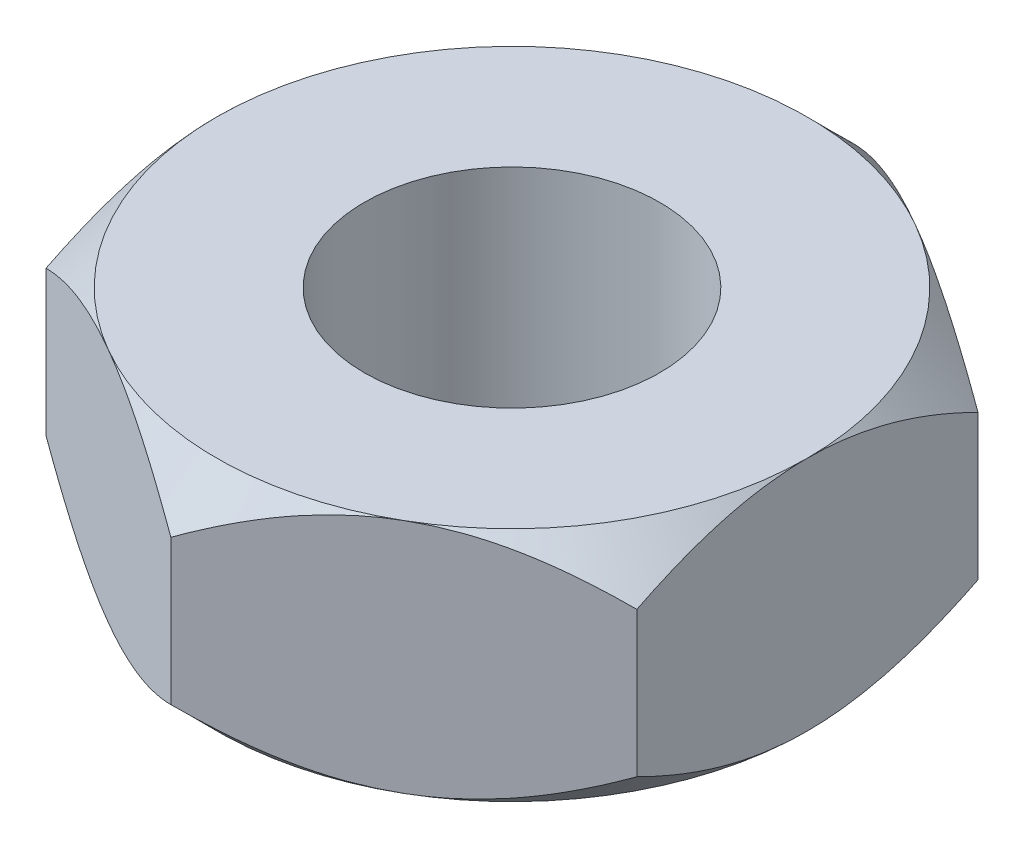
ISO-10303-21;
HEADER;
FILE_DESCRIPTION(('STEP AP214'),'2;1');
FILE_NAME('part.step','',(''),(''),'','','');
FILE_SCHEMA(('AUTOMOTIVE_DESIGN { 1 0 10303 214 1 1 1 1 }'));
ENDSEC;
DATA;
#1=APPLICATION_CONTEXT('core data for automotive mechanical design processes');
#2=APPLICATION_PROTOCOL_DEFINITION('international standard','automotive_design',2000,#1);
#3=PRODUCT_CONTEXT('',#1,'mechanical');
#4=PRODUCT('Part','Part','',(#3));
#5=PRODUCT_RELATED_PRODUCT_CATEGORY('part','',(#4));
#6=PRODUCT_DEFINITION_FORMATION('','',#4);
#7=PRODUCT_DEFINITION_CONTEXT('part definition',#1,'design');
#8=PRODUCT_DEFINITION('design','',#6,#7);
#9=PRODUCT_DEFINITION_SHAPE('','',#8);
#10=(LENGTH_UNIT() NAMED_UNIT(*) SI_UNIT(.MILLI.,.METRE.));
#11=(NAMED_UNIT(*) PLANE_ANGLE_UNIT() SI_UNIT($,.RADIAN.));
#12=(NAMED_UNIT(*) SI_UNIT($,.STERADIAN.) SOLID_ANGLE_UNIT());
#13=UNCERTAINTY_MEASURE_WITH_UNIT(LENGTH_MEASURE(1.E-05),#10,'distance_accuracy_value','');
#14=(GEOMETRIC_REPRESENTATION_CONTEXT(3) GLOBAL_UNCERTAINTY_ASSIGNED_CONTEXT((#13)) GLOBAL_UNIT_ASSIGNED_CONTEXT((#10,
#11,#12)) REPRESENTATION_CONTEXT('',''));
#15=CARTESIAN_POINT('',(0.,0.,0.));
#16=DIRECTION('',(0.,0.,1.));
#17=DIRECTION('',(1.,0.,0.));
#18=AXIS2_PLACEMENT_3D('',#15,#16,#17);
#19=CARTESIAN_POINT('',(2.5,2.,-1.44337567297407));
#20=DIRECTION('',(-0.5,0.,0.866025403784439));
#21=DIRECTION('',(0.866025403784439,0.,0.5));
#22=AXIS2_PLACEMENT_3D('',#19,#20,#21);
#23=PLANE('',#22);
#24=CARTESIAN_POINT('',(-0.000199999999999338,0.386866822929892,-2.88686681600197));
#25=CARTESIAN_POINT('',(0.0857382777877658,0.337292051302855,-2.83725032818751));
#26=CARTESIAN_POINT('',(0.173113567275755,0.290628827310634,-2.7868041812811));
#27=CARTESIAN_POINT('',(0.35128145616559,0.205189485986429,-2.6839389026696));
#28=CARTESIAN_POINT('',(0.442091000681076,0.166460908354131,-2.6315099876986));
#29=CARTESIAN_POINT('',(0.625204123126922,0.100118049845867,-2.52578957716234));
#30=CARTESIAN_POINT('',(0.717461064529342,0.0723370144789851,-2.47252500720904));
#31=CARTESIAN_POINT('',(0.904006008776287,0.0295345218587951,-2.3648232334321));
#32=CARTESIAN_POINT('',(0.998288312566284,0.0144811126194732,-2.31038931995913));
#33=CARTESIAN_POINT('',(1.16077825829185,0.000899068157610821,-2.21657570605387));
#34=CARTESIAN_POINT('',(1.22877596788015,-0.00111155481106936,-2.17731721011878));
#35=CARTESIAN_POINT('',(1.36466024116922,0.00227546313561769,-2.0988643883567));
#36=CARTESIAN_POINT('',(1.43254675755224,0.0076757012479502,-2.05967008984862));
#37=CARTESIAN_POINT('',(1.56767878823611,0.0255771343506018,-1.98165157555715));
#38=CARTESIAN_POINT('',(1.63492349975356,0.0380862729946106,-1.94282782326097));
#39=CARTESIAN_POINT('',(1.7682501008182,0.0695188479038369,-1.86585167424616));
#40=CARTESIAN_POINT('',(1.83433207909966,0.0884417924449483,-1.82769922629678));
#41=CARTESIAN_POINT('',(2.00359634669127,0.144618707356377,-1.72997445583858));
#42=CARTESIAN_POINT('',(2.10572912222289,0.186107177544317,-1.67100807039231));
#43=CARTESIAN_POINT('',(2.25590641494051,0.256145392671217,-1.58430317001562));
#44=CARTESIAN_POINT('',(2.30539653988261,0.280753598064203,-1.55573003305807));
#45=CARTESIAN_POINT('',(2.40346006383885,0.332213232663364,-1.49911303110426));
#46=CARTESIAN_POINT('',(2.45203400349693,0.359063284727484,-1.47106885396706));
#47=CARTESIAN_POINT('',(2.5002,0.386866822929892,-1.44326020292023));
#48=B_SPLINE_CURVE_WITH_KNOTS('',3,(#24,#25,#26,#27,#28,#29,#30,#31,#32,#33,#34,#35,#36,#37,#38,
#39,#40,#41,#42,#43,#44,#45,#46,#47),.UNSPECIFIED.,.F.,.F.,(4,2,2,2,2,2,2,2,2,2,2,4),(0.,
0.333012085133925,0.667964518301398,0.997597032043299,1.32639954393844,1.56169424147169,
1.79707142102083,2.03271213522171,2.26833478775651,2.64260240809533,2.82922877818864,
3.01574133749025),.UNSPECIFIED.);
#49=CARTESIAN_POINT('',(0.,0.386751345948129,-2.88675134594813));
#50=VERTEX_POINT('',#49);
#51=CARTESIAN_POINT('',(1.25,0.,-2.1650635094611));
#52=VERTEX_POINT('',#51);
#53=EDGE_CURVE('E52',#50,#52,#48,.T.);
#54=ORIENTED_EDGE('',*,*,#53,.F.);
#55=DIRECTION('',(0.,-1.,0.));
#56=VECTOR('',#55,1.);
#57=CARTESIAN_POINT('',(0.,2.,-2.88675134594813));
#58=LINE('',#57,#56);
#59=CARTESIAN_POINT('',(0.,1.61324865405187,-2.88675134594813));
#60=VERTEX_POINT('',#59);
#61=EDGE_CURVE('E278',#60,#50,#58,.T.);
#62=ORIENTED_EDGE('',*,*,#61,.F.);
#63=CARTESIAN_POINT('',(2.5002,1.61313317707011,-1.44326020292023));
#64=CARTESIAN_POINT('',(2.41426172221224,1.66270794869714,-1.49287669073469));
#65=CARTESIAN_POINT('',(2.32688643272425,1.70937117268937,-1.5433228376411));
#66=CARTESIAN_POINT('',(2.14871854383441,1.79481051401357,-1.64618811625259));
#67=CARTESIAN_POINT('',(2.05790899931892,1.83353909164587,-1.6986170312236));
#68=CARTESIAN_POINT('',(1.87479587687308,1.89988195015413,-1.80433744175986));
#69=CARTESIAN_POINT('',(1.78253893547066,1.92766298552102,-1.85760201171316));
#70=CARTESIAN_POINT('',(1.59599399122371,1.97046547814121,-1.96530378549009));
#71=CARTESIAN_POINT('',(1.50171168743372,1.98551888738053,-2.01973769896307));
#72=CARTESIAN_POINT('',(1.33922174170815,1.99910093184239,-2.11355131286833));
#73=CARTESIAN_POINT('',(1.27122403211985,2.00111155481107,-2.15280980880341));
#74=CARTESIAN_POINT('',(1.13533975883078,1.99772453686438,-2.2312626305655));
#75=CARTESIAN_POINT('',(1.06745324244776,1.99232429875205,-2.27045692907358));
#76=CARTESIAN_POINT('',(0.932321211763893,1.9744228656494,-2.34847544336505));
#77=CARTESIAN_POINT('',(0.865076500246439,1.96191372700539,-2.38729919566123));
#78=CARTESIAN_POINT('',(0.7317498991818,1.93048115209616,-2.46427534467604));
#79=CARTESIAN_POINT('',(0.665667920900342,1.91155820755505,-2.50242779262542));
#80=CARTESIAN_POINT('',(0.496403653308734,1.85538129264362,-2.60015256308362));
#81=CARTESIAN_POINT('',(0.394270877777107,1.81389282245568,-2.65911894852989));
#82=CARTESIAN_POINT('',(0.244093585059492,1.74385460732878,-2.74582384890657));
#83=CARTESIAN_POINT('',(0.194603460117391,1.7192464019358,-2.77439698586412));
#84=CARTESIAN_POINT('',(0.0965399361611543,1.66778676733664,-2.83101398781794));
#85=CARTESIAN_POINT('',(0.0479659965030732,1.64093671527252,-2.85905816495513));
#86=CARTESIAN_POINT('',(-0.000199999999998868,1.61313317707011,-2.88686681600197));
#87=B_SPLINE_CURVE_WITH_KNOTS('',3,(#63,#64,#65,#66,#67,#68,#69,#70,#71,#72,#73,#74,#75,#76,#77,
#78,#79,#80,#81,#82,#83,#84,#85,#86),.UNSPECIFIED.,.F.,.F.,(4,2,2,2,2,2,2,2,2,2,2,4),(0.,
0.333012085133924,0.667964518301397,0.997597032043299,1.32639954393844,1.56169424147169,
1.79707142102083,2.03271213522171,2.26833478775651,2.64260240809533,2.82922877818864,
3.01574133749025),.UNSPECIFIED.);
#88=CARTESIAN_POINT('',(1.25,2.,-2.1650635094611));
#89=VERTEX_POINT('',#88);
#90=EDGE_CURVE('E250',#89,#60,#87,.T.);
#91=ORIENTED_EDGE('',*,*,#90,.F.);
#92=CARTESIAN_POINT('',(2.5,1.61324865405187,-1.44337567297407));
#93=VERTEX_POINT('',#92);
#94=EDGE_CURVE('E318',#93,#89,#87,.T.);
#95=ORIENTED_EDGE('',*,*,#94,.F.);
#96=DIRECTION('',(0.,-1.,0.));
#97=VECTOR('',#96,1.);
#98=CARTESIAN_POINT('',(2.5,2.,-1.44337567297407));
#99=LINE('',#98,#97);
#100=CARTESIAN_POINT('',(2.5,0.386751345948128,-1.44337567297407));
#101=VERTEX_POINT('',#100);
#102=EDGE_CURVE('E320',#93,#101,#99,.T.);
#103=ORIENTED_EDGE('',*,*,#102,.T.);
#104=EDGE_CURVE('E137',#52,#101,#48,.T.);
#105=ORIENTED_EDGE('',*,*,#104,.F.);
#106=EDGE_LOOP('',(#54,#62,#91,#95,#103,#105));
#107=FACE_BOUND('',#106,.T.);
#108=ADVANCED_FACE('F36',(#107),#23,.F.);
#109=CARTESIAN_POINT('',(0.,2.,-2.88675134594813));
#110=DIRECTION('',(0.5,0.,0.866025403784439));
#111=DIRECTION('',(0.866025403784439,0.,-0.5));
#112=AXIS2_PLACEMENT_3D('',#109,#110,#111);
#113=PLANE('',#112);
#114=CARTESIAN_POINT('',(-2.5002,0.386866822929892,-1.44326020292023));
#115=CARTESIAN_POINT('',(-2.41426172221224,0.337292051302855,-1.49287669073469));
#116=CARTESIAN_POINT('',(-2.32688643272425,0.290628827310634,-1.5433228376411));
#117=CARTESIAN_POINT('',(-2.14871854383441,0.205189485986429,-1.64618811625259));
#118=CARTESIAN_POINT('',(-2.05790899931893,0.16646090835413,-1.6986170312236));
#119=CARTESIAN_POINT('',(-1.87479587687308,0.100118049845867,-1.80433744175986));
#120=CARTESIAN_POINT('',(-1.78253893547066,0.0723370144789846,-1.85760201171316));
#121=CARTESIAN_POINT('',(-1.59599399122371,0.0295345218587945,-1.96530378549009));
#122=CARTESIAN_POINT('',(-1.50171168743372,0.0144811126194725,-2.01973769896307));
#123=CARTESIAN_POINT('',(-1.33922174170815,0.000899068157610402,-2.11355131286833));
#124=CARTESIAN_POINT('',(-1.27122403211985,-0.00111155481106953,-2.15280980880341));
#125=CARTESIAN_POINT('',(-1.13533975883078,0.00227546313561764,-2.23126263056549));
#126=CARTESIAN_POINT('',(-1.06745324244776,0.00767570124795,-2.27045692907358));
#127=CARTESIAN_POINT('',(-0.932321211763893,0.0255771343506014,-2.34847544336505));
#128=CARTESIAN_POINT('',(-0.865076500246439,0.03808627299461,-2.38729919566123));
#129=CARTESIAN_POINT('',(-0.7317498991818,0.0695188479038363,-2.46427534467604));
#130=CARTESIAN_POINT('',(-0.665667920900342,0.0884417924449479,-2.50242779262542));
#131=CARTESIAN_POINT('',(-0.496403653308734,0.144618707356377,-2.60015256308362));
#132=CARTESIAN_POINT('',(-0.394270877777106,0.186107177544317,-2.65911894852989));
#133=CARTESIAN_POINT('',(-0.24409358505949,0.256145392671217,-2.74582384890657));
#134=CARTESIAN_POINT('',(-0.19460346011739,0.280753598064203,-2.77439698586412));
#135=CARTESIAN_POINT('',(-0.0965399361611525,0.332213232663364,-2.83101398781794));
#136=CARTESIAN_POINT('',(-0.0479659965030714,0.359063284727485,-2.85905816495513));
#137=CARTESIAN_POINT('',(0.000200000000000784,0.386866822929893,-2.88686681600197));
#138=B_SPLINE_CURVE_WITH_KNOTS('',3,(#114,#115,#116,#117,#118,#119,#120,#121,#122,#123,#124,
#125,#126,#127,#128,#129,#130,#131,#132,#133,#134,#135,#136,#137),.UNSPECIFIED.,.F.,.F.,(4,2,2,
2,2,2,2,2,2,2,2,4),(0.,0.333012085133925,0.667964518301398,0.9975970320433,1.32639954393844,
1.56169424147169,1.79707142102083,2.03271213522171,2.26833478775651,2.64260240809533,
2.82922877818864,3.01574133749025),.UNSPECIFIED.);
#139=CARTESIAN_POINT('',(-2.5,0.386751345948128,-1.44337567297407));
#140=VERTEX_POINT('',#139);
#141=CARTESIAN_POINT('',(-1.25,0.,-2.1650635094611));
#142=VERTEX_POINT('',#141);
#143=EDGE_CURVE('E60',#140,#142,#138,.T.);
#144=ORIENTED_EDGE('',*,*,#143,.F.);
#145=DIRECTION('',(0.,-1.,0.));
#146=VECTOR('',#145,1.);
#147=CARTESIAN_POINT('',(-2.5,2.,-1.44337567297407));
#148=LINE('',#147,#146);
#149=CARTESIAN_POINT('',(-2.5,1.61324865405187,-1.44337567297407));
#150=VERTEX_POINT('',#149);
#151=EDGE_CURVE('E271',#150,#140,#148,.T.);
#152=ORIENTED_EDGE('',*,*,#151,.F.);
#153=CARTESIAN_POINT('',(0.000200000000000751,1.61313317707011,-2.88686681600197));
#154=CARTESIAN_POINT('',(-0.0857382777877642,1.66270794869714,-2.83725032818751));
#155=CARTESIAN_POINT('',(-0.173113567275753,1.70937117268937,-2.7868041812811));
#156=CARTESIAN_POINT('',(-0.351281456165588,1.79481051401357,-2.6839389026696));
#157=CARTESIAN_POINT('',(-0.442091000681074,1.83353909164587,-2.6315099876986));
#158=CARTESIAN_POINT('',(-0.625204123126921,1.89988195015413,-2.52578957716234));
#159=CARTESIAN_POINT('',(-0.71746106452934,1.92766298552102,-2.47252500720904));
#160=CARTESIAN_POINT('',(-0.904006008776286,1.9704654781412,-2.3648232334321));
#161=CARTESIAN_POINT('',(-0.998288312566283,1.98551888738053,-2.31038931995913));
#162=CARTESIAN_POINT('',(-1.16077825829185,1.99910093184239,-2.21657570605387));
#163=CARTESIAN_POINT('',(-1.22877596788015,2.00111155481107,-2.17731721011878));
#164=CARTESIAN_POINT('',(-1.36466024116922,1.99772453686438,-2.0988643883567));
#165=CARTESIAN_POINT('',(-1.43254675755224,1.99232429875205,-2.05967008984862));
#166=CARTESIAN_POINT('',(-1.56767878823611,1.9744228656494,-1.98165157555715));
#167=CARTESIAN_POINT('',(-1.63492349975356,1.96191372700539,-1.94282782326097));
#168=CARTESIAN_POINT('',(-1.7682501008182,1.93048115209616,-1.86585167424616));
#169=CARTESIAN_POINT('',(-1.83433207909966,1.91155820755505,-1.82769922629678));
#170=CARTESIAN_POINT('',(-2.00359634669127,1.85538129264362,-1.72997445583858));
#171=CARTESIAN_POINT('',(-2.10572912222289,1.81389282245568,-1.67100807039231));
#172=CARTESIAN_POINT('',(-2.25590641494051,1.74385460732878,-1.58430317001562));
#173=CARTESIAN_POINT('',(-2.30539653988261,1.7192464019358,-1.55573003305807));
#174=CARTESIAN_POINT('',(-2.40346006383885,1.66778676733664,-1.49911303110426));
#175=CARTESIAN_POINT('',(-2.45203400349693,1.64093671527252,-1.47106885396706));
#176=CARTESIAN_POINT('',(-2.5002,1.61313317707011,-1.44326020292023));
#177=B_SPLINE_CURVE_WITH_KNOTS('',3,(#153,#154,#155,#156,#157,#158,#159,#160,#161,#162,#163,
#164,#165,#166,#167,#168,#169,#170,#171,#172,#173,#174,#175,#176),.UNSPECIFIED.,.F.,.F.,(4,2,2,
2,2,2,2,2,2,2,2,4),(0.,0.333012085133925,0.667964518301398,0.9975970320433,1.32639954393844,
1.56169424147169,1.79707142102083,2.03271213522171,2.26833478775651,2.64260240809533,
2.82922877818864,3.01574133749025),.UNSPECIFIED.);
#178=CARTESIAN_POINT('',(-1.25,2.,-2.1650635094611));
#179=VERTEX_POINT('',#178);
#180=EDGE_CURVE('E243',#179,#150,#177,.T.);
#181=ORIENTED_EDGE('',*,*,#180,.F.);
#182=EDGE_CURVE('E249',#60,#179,#177,.T.);
#183=ORIENTED_EDGE('',*,*,#182,.F.);
#184=ORIENTED_EDGE('',*,*,#61,.T.);
#185=EDGE_CURVE('E160',#142,#50,#138,.T.);
#186=ORIENTED_EDGE('',*,*,#185,.F.);
#187=EDGE_LOOP('',(#144,#152,#181,#183,#184,#186));
#188=FACE_BOUND('',#187,.T.);
#189=ADVANCED_FACE('F256',(#188),#113,.F.);
#190=CARTESIAN_POINT('',(-2.5,2.,-1.44337567297407));
#191=DIRECTION('',(1.,0.,0.));
#192=DIRECTION('',(0.,0.,-1.));
#193=AXIS2_PLACEMENT_3D('',#190,#191,#192);
#194=PLANE('',#193);
#195=CARTESIAN_POINT('',(-2.5,1.61274360316228,-3.26567909405567));
#196=CARTESIAN_POINT('',(-2.5,1.55080668033765,-3.1876597357196));
#197=CARTESIAN_POINT('',(-2.5,1.489354125676,-3.10925011326456));
#198=CARTESIAN_POINT('',(-2.5,1.36764674853936,-2.9514810930779));
#199=CARTESIAN_POINT('',(-2.5,1.30739218330598,-2.87212149709823));
#200=CARTESIAN_POINT('',(-2.5,1.1878844213843,-2.71170975539801));
#201=CARTESIAN_POINT('',(-2.5,1.12864229836218,-2.63064933443875));
#202=CARTESIAN_POINT('',(-2.5,1.01197598444938,-2.46723546824709));
#203=CARTESIAN_POINT('',(-2.5,0.954551672562325,-2.38488210962281));
#204=CARTESIAN_POINT('',(-2.5,0.837693856171789,-2.21235850361717));
#205=CARTESIAN_POINT('',(-2.5,0.778436853987643,-2.12206811516737));
#206=CARTESIAN_POINT('',(-2.5,0.663239415622615,-1.93935936342298));
#207=CARTESIAN_POINT('',(-2.5,0.607299596192161,-1.84694060881695));
#208=CARTESIAN_POINT('',(-2.5,0.499897293966414,-1.65988899862695));
#209=CARTESIAN_POINT('',(-2.5,0.448421799255687,-1.56526367289385));
#210=CARTESIAN_POINT('',(-2.5,0.351101364408176,-1.37318301361869));
#211=CARTESIAN_POINT('',(-2.5,0.305253588160801,-1.27572913640846));
#212=CARTESIAN_POINT('',(-2.5,0.22628725437335,-1.09029639896578));
#213=CARTESIAN_POINT('',(-2.5,0.192290940023054,-1.00269511248596));
#214=CARTESIAN_POINT('',(-2.5,0.131300227675576,-0.825041993603072));
#215=CARTESIAN_POINT('',(-2.5,0.104306230617393,-0.73499002120457));
#216=CARTESIAN_POINT('',(-2.5,0.0593415490779055,-0.554685314756036));
#217=CARTESIAN_POINT('',(-2.5,0.041188779393613,-0.464478815244774));
#218=CARTESIAN_POINT('',(-2.5,0.0143250807741684,-0.28266267034721));
#219=CARTESIAN_POINT('',(-2.5,0.0056114227313203,-0.191053438302298));
#220=CARTESIAN_POINT('',(-2.5,-0.00145424133300716,-0.0129543264737005));
#221=CARTESIAN_POINT('',(-2.5,-0.000397976929626955,0.0735120365543203));
#222=CARTESIAN_POINT('',(-2.5,0.0105883536211225,0.245874267573355));
#223=CARTESIAN_POINT('',(-2.5,0.0205191017096203,0.331770091211445));
#224=CARTESIAN_POINT('',(-2.5,0.0488246568319909,0.503842956116674));
#225=CARTESIAN_POINT('',(-2.5,0.0673591293116641,0.589993280937961));
#226=CARTESIAN_POINT('',(-2.5,0.111771145214338,0.760336458455045));
#227=CARTESIAN_POINT('',(-2.5,0.137648674951632,0.844529314798779));
#228=CARTESIAN_POINT('',(-2.5,0.224707317172841,1.09483730163166));
#229=CARTESIAN_POINT('',(-2.5,0.295134503606764,1.25774193664881));
#230=CARTESIAN_POINT('',(-2.5,0.412698798002815,1.49619216550169));
#231=CARTESIAN_POINT('',(-2.5,0.453962999838349,1.5748333423118));
#232=CARTESIAN_POINT('',(-2.5,0.539715609648841,1.73034188339433));
#233=CARTESIAN_POINT('',(-2.5,0.584203467228031,1.80720954752923));
#234=CARTESIAN_POINT('',(-2.5,0.673501697868623,1.95561959718083));
#235=CARTESIAN_POINT('',(-2.5,0.718187820400806,2.02723758587862));
#236=CARTESIAN_POINT('',(-2.5,0.809481081710538,2.16924442838932));
#237=CARTESIAN_POINT('',(-2.5,0.85608836195537,2.23963319114109));
#238=CARTESIAN_POINT('',(-2.5,0.950507988645338,2.37878146847468));
#239=CARTESIAN_POINT('',(-2.5,0.998307883594118,2.44754946719262));
#240=CARTESIAN_POINT('',(-2.5,1.09520282156358,2.58413952769418));
#241=CARTESIAN_POINT('',(-2.5,1.14429750444471,2.65196184465657));
#242=CARTESIAN_POINT('',(-2.5,1.19392283698374,2.71938704961064));
#243=B_SPLINE_CURVE_WITH_KNOTS('',3,(#195,#196,#197,#198,#199,#200,#201,#202,#203,#204,#205,
#206,#207,#208,#209,#210,#211,#212,#213,#214,#215,#216,#217,#218,#219,#220,#221,#222,#223,#224,
#225,#226,#227,#228,#229,#230,#231,#232,#233,#234,#235,#236,#237,#238,#239,#240,#241,#242),
.UNSPECIFIED.,.F.,.F.,(4,2,2,2,2,2,2,2,2,2,2,2,2,2,2,2,2,2,2,2,2,2,2,4),(0.,0.29885056163874,
0.597764616457264,0.898947760907934,1.20011081579959,1.52405067075365,1.84805056690858,
2.17107194014598,2.49392985127604,2.77559391837559,3.05727410945089,3.33287803908302,
3.60840226272653,3.86735363281682,4.1263249031945,4.39030698492101,4.65428857465111,
5.18509165483082,5.45149656772086,5.71785610225249,5.97107149106172,6.22430555918607,
6.47553611643667,6.72669751703712),.UNSPECIFIED.);
#244=CARTESIAN_POINT('',(-2.5,0.386751345948128,1.44337567297406));
#245=VERTEX_POINT('',#244);
#246=CARTESIAN_POINT('',(-2.5,0.,0.));
#247=VERTEX_POINT('',#246);
#248=EDGE_CURVE('E347',#245,#247,#243,.F.);
#249=ORIENTED_EDGE('',*,*,#248,.F.);
#250=DIRECTION('',(0.,-1.,0.));
#251=VECTOR('',#250,1.);
#252=CARTESIAN_POINT('',(-2.5,2.,1.44337567297406));
#253=LINE('',#252,#251);
#254=CARTESIAN_POINT('',(-2.5,1.61324865405187,1.44337567297406));
#255=VERTEX_POINT('',#254);
#256=EDGE_CURVE('E279',#255,#245,#253,.T.);
#257=ORIENTED_EDGE('',*,*,#256,.F.);
#258=CARTESIAN_POINT('',(-2.5,0.387256396837723,-3.26567909405567));
#259=CARTESIAN_POINT('',(-2.5,0.449193319662348,-3.1876597357196));
#260=CARTESIAN_POINT('',(-2.5,0.510645874324,-3.10925011326456));
#261=CARTESIAN_POINT('',(-2.5,0.632353251460638,-2.9514810930779));
#262=CARTESIAN_POINT('',(-2.5,0.692607816694021,-2.87212149709823));
#263=CARTESIAN_POINT('',(-2.5,0.812115578615702,-2.71170975539801));
#264=CARTESIAN_POINT('',(-2.5,0.871357701637818,-2.63064933443875));
#265=CARTESIAN_POINT('',(-2.5,0.988024015550616,-2.46723546824709));
#266=CARTESIAN_POINT('',(-2.5,1.04544832743768,-2.38488210962281));
#267=CARTESIAN_POINT('',(-2.5,1.16230614382821,-2.21235850361717));
#268=CARTESIAN_POINT('',(-2.5,1.22156314601236,-2.12206811516737));
#269=CARTESIAN_POINT('',(-2.5,1.33676058437739,-1.93935936342298));
#270=CARTESIAN_POINT('',(-2.5,1.39270040380784,-1.84694060881695));
#271=CARTESIAN_POINT('',(-2.5,1.50010270603359,-1.65988899862695));
#272=CARTESIAN_POINT('',(-2.5,1.55157820074431,-1.56526367289385));
#273=CARTESIAN_POINT('',(-2.5,1.64889863559182,-1.37318301361869));
#274=CARTESIAN_POINT('',(-2.5,1.6947464118392,-1.27572913640846));
#275=CARTESIAN_POINT('',(-2.5,1.77371274562665,-1.09029639896578));
#276=CARTESIAN_POINT('',(-2.5,1.80770905997695,-1.00269511248596));
#277=CARTESIAN_POINT('',(-2.5,1.86869977232442,-0.825041993603072));
#278=CARTESIAN_POINT('',(-2.5,1.89569376938261,-0.73499002120457));
#279=CARTESIAN_POINT('',(-2.5,1.94065845092209,-0.554685314756036));
#280=CARTESIAN_POINT('',(-2.5,1.95881122060639,-0.464478815244774));
#281=CARTESIAN_POINT('',(-2.5,1.98567491922583,-0.282662670347209));
#282=CARTESIAN_POINT('',(-2.5,1.99438857726868,-0.191053438302298));
#283=CARTESIAN_POINT('',(-2.5,2.00145424133301,-0.0129543264737002));
#284=CARTESIAN_POINT('',(-2.5,2.00039797692963,0.0735120365543206));
#285=CARTESIAN_POINT('',(-2.5,1.98941164637888,0.245874267573356));
#286=CARTESIAN_POINT('',(-2.5,1.97948089829038,0.331770091211446));
#287=CARTESIAN_POINT('',(-2.5,1.95117534316801,0.503842956116675));
#288=CARTESIAN_POINT('',(-2.5,1.93264087068834,0.589993280937961));
#289=CARTESIAN_POINT('',(-2.5,1.88822885478566,0.760336458455045));
#290=CARTESIAN_POINT('',(-2.5,1.86235132504837,0.844529314798779));
#291=CARTESIAN_POINT('',(-2.5,1.77529268282716,1.09483730163166));
#292=CARTESIAN_POINT('',(-2.5,1.70486549639324,1.25774193664881));
#293=CARTESIAN_POINT('',(-2.5,1.58730120199719,1.49619216550169));
#294=CARTESIAN_POINT('',(-2.5,1.54603700016165,1.5748333423118));
#295=CARTESIAN_POINT('',(-2.5,1.46028439035116,1.73034188339433));
#296=CARTESIAN_POINT('',(-2.5,1.41579653277197,1.80720954752923));
#297=CARTESIAN_POINT('',(-2.5,1.32649830213138,1.95561959718083));
#298=CARTESIAN_POINT('',(-2.5,1.28181217959919,2.02723758587862));
#299=CARTESIAN_POINT('',(-2.5,1.19051891828946,2.16924442838932));
#300=CARTESIAN_POINT('',(-2.5,1.14391163804463,2.23963319114109));
#301=CARTESIAN_POINT('',(-2.5,1.04949201135466,2.37878146847468));
#302=CARTESIAN_POINT('',(-2.5,1.00169211640588,2.44754946719262));
#303=CARTESIAN_POINT('',(-2.5,0.904797178436418,2.58413952769418));
#304=CARTESIAN_POINT('',(-2.5,0.855702495555293,2.65196184465657));
#305=CARTESIAN_POINT('',(-2.5,0.806077163016257,2.71938704961064));
#306=B_SPLINE_CURVE_WITH_KNOTS('',3,(#258,#259,#260,#261,#262,#263,#264,#265,#266,#267,#268,
#269,#270,#271,#272,#273,#274,#275,#276,#277,#278,#279,#280,#281,#282,#283,#284,#285,#286,#287,
#288,#289,#290,#291,#292,#293,#294,#295,#296,#297,#298,#299,#300,#301,#302,#303,#304,#305),
.UNSPECIFIED.,.F.,.F.,(4,2,2,2,2,2,2,2,2,2,2,2,2,2,2,2,2,2,2,2,2,2,2,4),(0.,0.29885056163874,
0.597764616457264,0.898947760907935,1.20011081579959,1.52405067075365,1.84805056690858,
2.17107194014598,2.49392985127604,2.77559391837559,3.05727410945089,3.33287803908303,
3.60840226272653,3.86735363281682,4.12632490319451,4.39030698492101,4.65428857465111,
5.18509165483082,5.45149656772086,5.71785610225249,5.97107149106172,6.22430555918608,
6.47553611643667,6.72669751703712),.UNSPECIFIED.);
#307=CARTESIAN_POINT('',(-2.5,2.,0.));
#308=VERTEX_POINT('',#307);
#309=EDGE_CURVE('E236',#308,#255,#306,.T.);
#310=ORIENTED_EDGE('',*,*,#309,.F.);
#311=EDGE_CURVE('E242',#150,#308,#306,.T.);
#312=ORIENTED_EDGE('',*,*,#311,.F.);
#313=ORIENTED_EDGE('',*,*,#151,.T.);
#314=EDGE_CURVE('E195',#247,#140,#243,.F.);
#315=ORIENTED_EDGE('',*,*,#314,.F.);
#316=EDGE_LOOP('',(#249,#257,#310,#312,#313,#315));
#317=FACE_BOUND('',#316,.T.);
#318=ADVANCED_FACE('F217',(#317),#194,.F.);
#319=CARTESIAN_POINT('',(-2.5,2.,1.44337567297406));
#320=DIRECTION('',(0.5,0.,-0.866025403784439));
#321=DIRECTION('',(-0.866025403784438,0.,-0.5));
#322=AXIS2_PLACEMENT_3D('',#319,#320,#321);
#323=PLANE('',#322);
#324=CARTESIAN_POINT('',(0.000199999999999947,0.386866822929892,2.88686681600197));
#325=CARTESIAN_POINT('',(-0.0857382777877645,0.337292051302855,2.83725032818751));
#326=CARTESIAN_POINT('',(-0.173113567275753,0.290628827310633,2.7868041812811));
#327=CARTESIAN_POINT('',(-0.351281456165589,0.205189485986429,2.6839389026696));
#328=CARTESIAN_POINT('',(-0.442091000681075,0.16646090835413,2.6315099876986));
#329=CARTESIAN_POINT('',(-0.625204123126922,0.100118049845867,2.52578957716234));
#330=CARTESIAN_POINT('',(-0.717461064529341,0.0723370144789846,2.47252500720904));
#331=CARTESIAN_POINT('',(-0.904006008776287,0.0295345218587941,2.3648232334321));
#332=CARTESIAN_POINT('',(-0.998288312566284,0.0144811126194721,2.31038931995913));
#333=CARTESIAN_POINT('',(-1.16077825829185,0.00089906815760981,2.21657570605387));
#334=CARTESIAN_POINT('',(-1.22877596788015,-0.00111155481107021,2.17731721011878));
#335=CARTESIAN_POINT('',(-1.36466024116922,0.00227546313561681,2.0988643883567));
#336=CARTESIAN_POINT('',(-1.43254675755224,0.00767570124794913,2.05967008984862));
#337=CARTESIAN_POINT('',(-1.56767878823611,0.0255771343506007,1.98165157555715));
#338=CARTESIAN_POINT('',(-1.63492349975356,0.0380862729946096,1.94282782326097));
#339=CARTESIAN_POINT('',(-1.7682501008182,0.069518847903836,1.86585167424616));
#340=CARTESIAN_POINT('',(-1.83433207909966,0.0884417924449473,1.82769922629678));
#341=CARTESIAN_POINT('',(-2.00359634669127,0.144618707356376,1.72997445583858));
#342=CARTESIAN_POINT('',(-2.10572912222289,0.186107177544316,1.67100807039231));
#343=CARTESIAN_POINT('',(-2.25590641494051,0.256145392671216,1.58430317001562));
#344=CARTESIAN_POINT('',(-2.30539653988261,0.280753598064202,1.55573003305807));
#345=CARTESIAN_POINT('',(-2.40346006383885,0.332213232663363,1.49911303110426));
#346=CARTESIAN_POINT('',(-2.45203400349693,0.359063284727484,1.47106885396706));
#347=CARTESIAN_POINT('',(-2.5002,0.386866822929892,1.44326020292023));
#348=B_SPLINE_CURVE_WITH_KNOTS('',3,(#324,#325,#326,#327,#328,#329,#330,#331,#332,#333,#334,
#335,#336,#337,#338,#339,#340,#341,#342,#343,#344,#345,#346,#347),.UNSPECIFIED.,.F.,.F.,(4,2,2,
2,2,2,2,2,2,2,2,4),(0.,0.333012085133925,0.667964518301398,0.9975970320433,1.32639954393844,
1.56169424147169,1.79707142102083,2.03271213522171,2.26833478775651,2.64260240809533,
2.82922877818864,3.01574133749025),.UNSPECIFIED.);
#349=CARTESIAN_POINT('',(0.,0.386751345948128,2.88675134594813));
#350=VERTEX_POINT('',#349);
#351=CARTESIAN_POINT('',(-1.25,0.,2.1650635094611));
#352=VERTEX_POINT('',#351);
#353=EDGE_CURVE('E146',#350,#352,#348,.T.);
#354=ORIENTED_EDGE('',*,*,#353,.F.);
#355=DIRECTION('',(0.,-1.,0.));
#356=VECTOR('',#355,1.);
#357=CARTESIAN_POINT('',(0.,2.,2.88675134594813));
#358=LINE('',#357,#356);
#359=CARTESIAN_POINT('',(0.,1.61324865405187,2.88675134594813));
#360=VERTEX_POINT('',#359);
#361=EDGE_CURVE('E159',#360,#350,#358,.T.);
#362=ORIENTED_EDGE('',*,*,#361,.F.);
#363=CARTESIAN_POINT('',(-2.5002,1.61313317707011,1.44326020292023));
#364=CARTESIAN_POINT('',(-2.41426172221224,1.66270794869715,1.49287669073469));
#365=CARTESIAN_POINT('',(-2.32688643272425,1.70937117268937,1.5433228376411));
#366=CARTESIAN_POINT('',(-2.14871854383441,1.79481051401357,1.64618811625259));
#367=CARTESIAN_POINT('',(-2.05790899931893,1.83353909164587,1.69861703122359));
#368=CARTESIAN_POINT('',(-1.87479587687308,1.89988195015413,1.80433744175986));
#369=CARTESIAN_POINT('',(-1.78253893547066,1.92766298552102,1.85760201171316));
#370=CARTESIAN_POINT('',(-1.59599399122371,1.97046547814121,1.96530378549009));
#371=CARTESIAN_POINT('',(-1.50171168743372,1.98551888738053,2.01973769896307));
#372=CARTESIAN_POINT('',(-1.33922174170815,1.99910093184239,2.11355131286833));
#373=CARTESIAN_POINT('',(-1.27122403211985,2.00111155481107,2.15280980880341));
#374=CARTESIAN_POINT('',(-1.13533975883078,1.99772453686438,2.23126263056549));
#375=CARTESIAN_POINT('',(-1.06745324244776,1.99232429875205,2.27045692907358));
#376=CARTESIAN_POINT('',(-0.932321211763894,1.9744228656494,2.34847544336505));
#377=CARTESIAN_POINT('',(-0.865076500246439,1.96191372700539,2.38729919566123));
#378=CARTESIAN_POINT('',(-0.7317498991818,1.93048115209616,2.46427534467604));
#379=CARTESIAN_POINT('',(-0.665667920900342,1.91155820755505,2.50242779262542));
#380=CARTESIAN_POINT('',(-0.496403653308735,1.85538129264362,2.60015256308362));
#381=CARTESIAN_POINT('',(-0.394270877777107,1.81389282245568,2.65911894852989));
#382=CARTESIAN_POINT('',(-0.244093585059491,1.74385460732878,2.74582384890657));
#383=CARTESIAN_POINT('',(-0.19460346011739,1.7192464019358,2.77439698586412));
#384=CARTESIAN_POINT('',(-0.0965399361611529,1.66778676733664,2.83101398781794));
#385=CARTESIAN_POINT('',(-0.0479659965030718,1.64093671527252,2.85905816495513));
#386=CARTESIAN_POINT('',(0.000200000000000272,1.61313317707011,2.88686681600197));
#387=B_SPLINE_CURVE_WITH_KNOTS('',3,(#363,#364,#365,#366,#367,#368,#369,#370,#371,#372,#373,
#374,#375,#376,#377,#378,#379,#380,#381,#382,#383,#384,#385,#386),.UNSPECIFIED.,.F.,.F.,(4,2,2,
2,2,2,2,2,2,2,2,4),(0.,0.333012085133925,0.667964518301398,0.9975970320433,1.32639954393844,
1.56169424147169,1.79707142102083,2.03271213522171,2.26833478775651,2.64260240809533,
2.82922877818864,3.01574133749025),.UNSPECIFIED.);
#388=CARTESIAN_POINT('',(-1.25,2.,2.1650635094611));
#389=VERTEX_POINT('',#388);
#390=EDGE_CURVE('E222',#389,#360,#387,.T.);
#391=ORIENTED_EDGE('',*,*,#390,.F.);
#392=EDGE_CURVE('E229',#255,#389,#387,.T.);
#393=ORIENTED_EDGE('',*,*,#392,.F.);
#394=ORIENTED_EDGE('',*,*,#256,.T.);
#395=EDGE_CURVE('E162',#352,#245,#348,.T.);
#396=ORIENTED_EDGE('',*,*,#395,.F.);
#397=EDGE_LOOP('',(#354,#362,#391,#393,#394,#396));
#398=FACE_BOUND('',#397,.T.);
#399=ADVANCED_FACE('F214',(#398),#323,.F.);
#400=CARTESIAN_POINT('',(0.,2.,2.88675134594813));
#401=DIRECTION('',(-0.5,0.,-0.866025403784439));
#402=DIRECTION('',(-0.866025403784439,0.,0.5));
#403=AXIS2_PLACEMENT_3D('',#400,#401,#402);
#404=PLANE('',#403);
#405=CARTESIAN_POINT('',(2.5002,0.386866822929892,1.44326020292023));
#406=CARTESIAN_POINT('',(2.41426172221223,0.337292051302855,1.49287669073469));
#407=CARTESIAN_POINT('',(2.32688643272425,0.290628827310633,1.5433228376411));
#408=CARTESIAN_POINT('',(2.14871854383441,0.205189485986429,1.64618811625259));
#409=CARTESIAN_POINT('',(2.05790899931893,0.166460908354131,1.6986170312236));
#410=CARTESIAN_POINT('',(1.87479587687308,0.100118049845867,1.80433744175986));
#411=CARTESIAN_POINT('',(1.78253893547066,0.0723370144789847,1.85760201171316));
#412=CARTESIAN_POINT('',(1.59599399122371,0.0295345218587946,1.96530378549009));
#413=CARTESIAN_POINT('',(1.50171168743372,0.014481112619473,2.01973769896307));
#414=CARTESIAN_POINT('',(1.33922174170815,0.000899068157610807,2.11355131286833));
#415=CARTESIAN_POINT('',(1.27122403211985,-0.00111155481106932,2.15280980880341));
#416=CARTESIAN_POINT('',(1.13533975883078,0.00227546313561744,2.23126263056549));
#417=CARTESIAN_POINT('',(1.06745324244776,0.00767570124794961,2.27045692907358));
#418=CARTESIAN_POINT('',(0.932321211763894,0.0255771343506011,2.34847544336505));
#419=CARTESIAN_POINT('',(0.86507650024644,0.03808627299461,2.38729919566123));
#420=CARTESIAN_POINT('',(0.731749899181801,0.0695188479038364,2.46427534467604));
#421=CARTESIAN_POINT('',(0.665667920900343,0.0884417924449478,2.50242779262542));
#422=CARTESIAN_POINT('',(0.496403653308735,0.144618707356376,2.60015256308362));
#423=CARTESIAN_POINT('',(0.394270877777107,0.186107177544316,2.65911894852989));
#424=CARTESIAN_POINT('',(0.244093585059491,0.256145392671217,2.74582384890657));
#425=CARTESIAN_POINT('',(0.194603460117391,0.280753598064202,2.77439698586412));
#426=CARTESIAN_POINT('',(0.0965399361611536,0.332213232663364,2.83101398781794));
#427=CARTESIAN_POINT('',(0.0479659965030723,0.359063284727484,2.85905816495513));
#428=CARTESIAN_POINT('',(-0.000199999999999848,0.386866822929892,2.88686681600197));
#429=B_SPLINE_CURVE_WITH_KNOTS('',3,(#405,#406,#407,#408,#409,#410,#411,#412,#413,#414,#415,
#416,#417,#418,#419,#420,#421,#422,#423,#424,#425,#426,#427,#428),.UNSPECIFIED.,.F.,.F.,(4,2,2,
2,2,2,2,2,2,2,2,4),(0.,0.333012085133923,0.667964518301396,0.997597032043298,1.32639954393844,
1.56169424147168,1.79707142102083,2.03271213522171,2.2683347877565,2.64260240809533,
2.82922877818864,3.01574133749025),.UNSPECIFIED.);
#430=CARTESIAN_POINT('',(2.5,0.386751345948128,1.44337567297407));
#431=VERTEX_POINT('',#430);
#432=CARTESIAN_POINT('',(1.25,0.,2.1650635094611));
#433=VERTEX_POINT('',#432);
#434=EDGE_CURVE('E126',#431,#433,#429,.T.);
#435=ORIENTED_EDGE('',*,*,#434,.F.);
#436=DIRECTION('',(0.,-1.,0.));
#437=VECTOR('',#436,1.);
#438=CARTESIAN_POINT('',(2.5,2.,1.44337567297407));
#439=LINE('',#438,#437);
#440=CARTESIAN_POINT('',(2.5,1.61324865405187,1.44337567297407));
#441=VERTEX_POINT('',#440);
#442=EDGE_CURVE('E325',#441,#431,#439,.T.);
#443=ORIENTED_EDGE('',*,*,#442,.F.);
#444=CARTESIAN_POINT('',(-0.000200000000000088,1.61313317707011,2.88686681600197));
#445=CARTESIAN_POINT('',(0.0857382777877648,1.66270794869714,2.83725032818751));
#446=CARTESIAN_POINT('',(0.173113567275753,1.70937117268937,2.7868041812811));
#447=CARTESIAN_POINT('',(0.351281456165588,1.79481051401357,2.6839389026696));
#448=CARTESIAN_POINT('',(0.442091000681074,1.83353909164587,2.6315099876986));
#449=CARTESIAN_POINT('',(0.625204123126921,1.89988195015413,2.52578957716234));
#450=CARTESIAN_POINT('',(0.71746106452934,1.92766298552101,2.47252500720904));
#451=CARTESIAN_POINT('',(0.904006008776286,1.97046547814121,2.3648232334321));
#452=CARTESIAN_POINT('',(0.998288312566283,1.98551888738053,2.31038931995913));
#453=CARTESIAN_POINT('',(1.16077825829185,1.99910093184239,2.21657570605387));
#454=CARTESIAN_POINT('',(1.22877596788015,2.00111155481107,2.17731721011878));
#455=CARTESIAN_POINT('',(1.36466024116922,1.99772453686438,2.0988643883567));
#456=CARTESIAN_POINT('',(1.43254675755224,1.99232429875205,2.05967008984862));
#457=CARTESIAN_POINT('',(1.56767878823611,1.9744228656494,1.98165157555715));
#458=CARTESIAN_POINT('',(1.63492349975356,1.96191372700539,1.94282782326097));
#459=CARTESIAN_POINT('',(1.7682501008182,1.93048115209616,1.86585167424616));
#460=CARTESIAN_POINT('',(1.83433207909966,1.91155820755505,1.82769922629678));
#461=CARTESIAN_POINT('',(2.00359634669126,1.85538129264362,1.72997445583858));
#462=CARTESIAN_POINT('',(2.10572912222289,1.81389282245568,1.67100807039231));
#463=CARTESIAN_POINT('',(2.25590641494051,1.74385460732878,1.58430317001562));
#464=CARTESIAN_POINT('',(2.30539653988261,1.7192464019358,1.55573003305807));
#465=CARTESIAN_POINT('',(2.40346006383885,1.66778676733664,1.49911303110426));
#466=CARTESIAN_POINT('',(2.45203400349693,1.64093671527252,1.47106885396706));
#467=CARTESIAN_POINT('',(2.5002,1.61313317707011,1.44326020292023));
#468=B_SPLINE_CURVE_WITH_KNOTS('',3,(#444,#445,#446,#447,#448,#449,#450,#451,#452,#453,#454,
#455,#456,#457,#458,#459,#460,#461,#462,#463,#464,#465,#466,#467),.UNSPECIFIED.,.F.,.F.,(4,2,2,
2,2,2,2,2,2,2,2,4),(0.,0.333012085133924,0.667964518301397,0.997597032043299,1.32639954393844,
1.56169424147169,1.79707142102083,2.03271213522171,2.26833478775651,2.64260240809533,
2.82922877818864,3.01574133749025),.UNSPECIFIED.);
#469=CARTESIAN_POINT('',(1.25,2.,2.1650635094611));
#470=VERTEX_POINT('',#469);
#471=EDGE_CURVE('E231',#470,#441,#468,.T.);
#472=ORIENTED_EDGE('',*,*,#471,.F.);
#473=EDGE_CURVE('E230',#360,#470,#468,.T.);
#474=ORIENTED_EDGE('',*,*,#473,.F.);
#475=ORIENTED_EDGE('',*,*,#361,.T.);
#476=EDGE_CURVE('E140',#433,#350,#429,.T.);
#477=ORIENTED_EDGE('',*,*,#476,.F.);
#478=EDGE_LOOP('',(#435,#443,#472,#474,#475,#477));
#479=FACE_BOUND('',#478,.T.);
#480=ADVANCED_FACE('F156',(#479),#404,.F.);
#481=CARTESIAN_POINT('',(2.5,2.,1.44337567297407));
#482=DIRECTION('',(-1.,0.,0.));
#483=DIRECTION('',(0.,0.,1.));
#484=AXIS2_PLACEMENT_3D('',#481,#482,#483);
#485=PLANE('',#484);
#486=CARTESIAN_POINT('',(2.5,1.61274360511527,-3.26567909651524));
#487=CARTESIAN_POINT('',(2.5,1.55080668221465,-3.18765973810514));
#488=CARTESIAN_POINT('',(2.5,1.4893541274771,-3.10925011557588));
#489=CARTESIAN_POINT('',(2.5,1.36764675018908,-2.95148109524015));
#490=CARTESIAN_POINT('',(2.5,1.30739218488022,-2.87212149918564));
#491=CARTESIAN_POINT('',(2.5,1.18788442280694,-2.71170975733337));
#492=CARTESIAN_POINT('',(2.5,1.12864229970874,-2.63064933629691));
#493=CARTESIAN_POINT('',(2.5,1.01197598564488,-2.46723546994961));
#494=CARTESIAN_POINT('',(2.5,0.954551673682837,-2.38488211124691));
#495=CARTESIAN_POINT('',(2.5,0.837693857134853,-2.21235850507149));
#496=CARTESIAN_POINT('',(2.5,0.778436854868525,-2.12206811653009));
#497=CARTESIAN_POINT('',(2.5,0.663239416342633,-1.93935936459939));
#498=CARTESIAN_POINT('',(2.5,0.607299596833498,-1.84694060989864));
#499=CARTESIAN_POINT('',(2.5,0.499897294456617,-1.65988899951586));
#500=CARTESIAN_POINT('',(2.5,0.448421799673393,-1.56526367368473));
#501=CARTESIAN_POINT('',(2.5,0.351101364689805,-1.37318301420806));
#502=CARTESIAN_POINT('',(2.5,0.305253588378838,-1.27572913689436));
#503=CARTESIAN_POINT('',(2.5,0.226287254552743,-1.0902963994098));
#504=CARTESIAN_POINT('',(2.5,0.19229094021549,-1.00269511299677));
#505=CARTESIAN_POINT('',(2.5,0.131300227880851,-0.825041994250671));
#506=CARTESIAN_POINT('',(2.5,0.104306230822472,-0.734990021922161));
#507=CARTESIAN_POINT('',(2.5,0.0593415492657675,-0.55468531561172));
#508=CARTESIAN_POINT('',(2.5,0.0411887795650003,-0.464478816168471));
#509=CARTESIAN_POINT('',(2.5,0.0143250808957318,-0.282662671405774));
#510=CARTESIAN_POINT('',(2.5,0.00561142281954559,-0.191053439427716));
#511=CARTESIAN_POINT('',(2.5,-0.0014542413253375,-0.0129543276998145));
#512=CARTESIAN_POINT('',(2.5,-0.000397976965706839,0.0735120352942112));
#513=CARTESIAN_POINT('',(2.5,0.0105883534925217,0.245874266250167));
#514=CARTESIAN_POINT('',(2.5,0.0205191015322411,0.331770089859174));
#515=CARTESIAN_POINT('',(2.5,0.0488246565541103,0.503842954707065));
#516=CARTESIAN_POINT('',(2.5,0.0673591289817086,0.589993279500243));
#517=CARTESIAN_POINT('',(2.5,0.111771144780917,0.760336456964871));
#518=CARTESIAN_POINT('',(2.5,0.137648674466821,0.844529313284258));
#519=CARTESIAN_POINT('',(2.5,0.22470731645308,1.09483729980585));
#520=CARTESIAN_POINT('',(2.5,0.295134502671739,1.25774193455184));
#521=CARTESIAN_POINT('',(2.5,0.412698796727115,1.49619216301442));
#522=CARTESIAN_POINT('',(2.5,0.453962998445754,1.57483333969673));
#523=CARTESIAN_POINT('',(2.5,0.539715608018637,1.73034188052779));
#524=CARTESIAN_POINT('',(2.5,0.584203465477114,1.80720954453903));
#525=CARTESIAN_POINT('',(2.5,0.673501695888932,1.95561959396691));
#526=CARTESIAN_POINT('',(2.5,0.718187818313627,2.02723758256421));
#527=CARTESIAN_POINT('',(2.5,0.809481079407936,2.16924442487539));
#528=CARTESIAN_POINT('',(2.5,0.856088359544831,2.23963318752812));
#529=CARTESIAN_POINT('',(2.5,0.950507986020164,2.37878146466605));
#530=CARTESIAN_POINT('',(2.5,0.998307880862258,2.44754946328735));
#531=CARTESIAN_POINT('',(2.5,1.0952028186185,2.58413952359629));
#532=CARTESIAN_POINT('',(2.5,1.14429750139309,2.65196184046268));
#533=CARTESIAN_POINT('',(2.5,1.19392283382575,2.71938704532092));
#534=B_SPLINE_CURVE_WITH_KNOTS('',3,(#486,#487,#488,#489,#490,#491,#492,#493,#494,#495,#496,
#497,#498,#499,#500,#501,#502,#503,#504,#505,#506,#507,#508,#509,#510,#511,#512,#513,#514,#515,
#516,#517,#518,#519,#520,#521,#522,#523,#524,#525,#526,#527,#528,#529,#530,#531,#532,#533),
.UNSPECIFIED.,.F.,.F.,(4,2,2,2,2,2,2,2,2,2,2,2,2,2,2,2,2,2,2,2,2,2,2,4),(0.,0.298850561954431,
0.597764617088737,0.898947761861096,1.20011081707439,1.52405067239339,1.84805056891351,
2.17107194251295,2.49392985400439,2.77559392090368,3.05727411177907,3.3328780412222,
3.60840226467695,3.86735363466416,4.12632490493857,4.39030698654974,4.65428857616457,
5.18509165534597,5.45149656773342,5.71785610176266,5.9710714901454,6.22430555784323,
6.47553611467308,6.72669751485283),.UNSPECIFIED.);
#535=CARTESIAN_POINT('',(2.5,0.,0.));
#536=VERTEX_POINT('',#535);
#537=EDGE_CURVE('E138',#101,#536,#534,.T.);
#538=ORIENTED_EDGE('',*,*,#537,.F.);
#539=ORIENTED_EDGE('',*,*,#102,.F.);
#540=CARTESIAN_POINT('',(2.5,0.387256394884734,-3.26567909651524));
#541=CARTESIAN_POINT('',(2.5,0.449193317785354,-3.18765973810514));
#542=CARTESIAN_POINT('',(2.5,0.510645872522899,-3.10925011557588));
#543=CARTESIAN_POINT('',(2.5,0.632353249810915,-2.95148109524015));
#544=CARTESIAN_POINT('',(2.5,0.692607815119784,-2.87212149918564));
#545=CARTESIAN_POINT('',(2.5,0.812115577193056,-2.71170975733338));
#546=CARTESIAN_POINT('',(2.5,0.871357700291254,-2.63064933629691));
#547=CARTESIAN_POINT('',(2.5,0.988024014355119,-2.46723546994961));
#548=CARTESIAN_POINT('',(2.5,1.04544832631716,-2.38488211124691));
#549=CARTESIAN_POINT('',(2.5,1.16230614286515,-2.21235850507149));
#550=CARTESIAN_POINT('',(2.5,1.22156314513147,-2.12206811653009));
#551=CARTESIAN_POINT('',(2.5,1.33676058365737,-1.93935936459939));
#552=CARTESIAN_POINT('',(2.5,1.3927004031665,-1.84694060989864));
#553=CARTESIAN_POINT('',(2.5,1.50010270554338,-1.65988899951586));
#554=CARTESIAN_POINT('',(2.5,1.55157820032661,-1.56526367368473));
#555=CARTESIAN_POINT('',(2.5,1.64889863531019,-1.37318301420806));
#556=CARTESIAN_POINT('',(2.5,1.69474641162116,-1.27572913689436));
#557=CARTESIAN_POINT('',(2.5,1.77371274544726,-1.0902963994098));
#558=CARTESIAN_POINT('',(2.5,1.80770905978451,-1.00269511299677));
#559=CARTESIAN_POINT('',(2.5,1.86869977211915,-0.825041994250671));
#560=CARTESIAN_POINT('',(2.5,1.89569376917753,-0.734990021922161));
#561=CARTESIAN_POINT('',(2.5,1.94065845073423,-0.55468531561172));
#562=CARTESIAN_POINT('',(2.5,1.958811220435,-0.464478816168471));
#563=CARTESIAN_POINT('',(2.5,1.98567491910427,-0.282662671405774));
#564=CARTESIAN_POINT('',(2.5,1.99438857718045,-0.191053439427715));
#565=CARTESIAN_POINT('',(2.5,2.00145424132534,-0.0129543276998144));
#566=CARTESIAN_POINT('',(2.5,2.00039797696571,0.0735120352942114));
#567=CARTESIAN_POINT('',(2.5,1.98941164650748,0.245874266250167));
#568=CARTESIAN_POINT('',(2.5,1.97948089846776,0.331770089859174));
#569=CARTESIAN_POINT('',(2.5,1.95117534344589,0.503842954707065));
#570=CARTESIAN_POINT('',(2.5,1.93264087101829,0.589993279500243));
#571=CARTESIAN_POINT('',(2.5,1.88822885521908,0.760336456964871));
#572=CARTESIAN_POINT('',(2.5,1.86235132553318,0.844529313284259));
#573=CARTESIAN_POINT('',(2.5,1.77529268354692,1.09483729980585));
#574=CARTESIAN_POINT('',(2.5,1.70486549732826,1.25774193455184));
#575=CARTESIAN_POINT('',(2.5,1.58730120327289,1.49619216301442));
#576=CARTESIAN_POINT('',(2.5,1.54603700155425,1.57483333969673));
#577=CARTESIAN_POINT('',(2.5,1.46028439198136,1.73034188052779));
#578=CARTESIAN_POINT('',(2.5,1.41579653452289,1.80720954453903));
#579=CARTESIAN_POINT('',(2.5,1.32649830411107,1.95561959396691));
#580=CARTESIAN_POINT('',(2.5,1.28181218168637,2.02723758256421));
#581=CARTESIAN_POINT('',(2.5,1.19051892059206,2.16924442487539));
#582=CARTESIAN_POINT('',(2.5,1.14391164045517,2.23963318752812));
#583=CARTESIAN_POINT('',(2.5,1.04949201397984,2.37878146466605));
#584=CARTESIAN_POINT('',(2.5,1.00169211913774,2.44754946328736));
#585=CARTESIAN_POINT('',(2.5,0.904797181381497,2.58413952359629));
#586=CARTESIAN_POINT('',(2.5,0.855702498606908,2.65196184046268));
#587=CARTESIAN_POINT('',(2.5,0.806077166174253,2.71938704532092));
#588=B_SPLINE_CURVE_WITH_KNOTS('',3,(#540,#541,#542,#543,#544,#545,#546,#547,#548,#549,#550,
#551,#552,#553,#554,#555,#556,#557,#558,#559,#560,#561,#562,#563,#564,#565,#566,#567,#568,#569,
#570,#571,#572,#573,#574,#575,#576,#577,#578,#579,#580,#581,#582,#583,#584,#585,#586,#587),
.UNSPECIFIED.,.F.,.F.,(4,2,2,2,2,2,2,2,2,2,2,2,2,2,2,2,2,2,2,2,2,2,2,4),(0.,0.298850561954431,
0.597764617088736,0.898947761861095,1.20011081707439,1.52405067239339,1.84805056891351,
2.17107194251295,2.49392985400439,2.77559392090368,3.05727411177907,3.3328780412222,
3.60840226467695,3.86735363466416,4.12632490493857,4.39030698654974,4.65428857616457,
5.18509165534598,5.45149656773342,5.71785610176266,5.9710714901454,6.22430555784324,
6.47553611467309,6.72669751485283),.UNSPECIFIED.);
#589=CARTESIAN_POINT('',(2.5,2.,0.));
#590=VERTEX_POINT('',#589);
#591=EDGE_CURVE('E281',#590,#93,#588,.F.);
#592=ORIENTED_EDGE('',*,*,#591,.F.);
#593=EDGE_CURVE('E151',#441,#590,#588,.F.);
#594=ORIENTED_EDGE('',*,*,#593,.F.);
#595=ORIENTED_EDGE('',*,*,#442,.T.);
#596=EDGE_CURVE('E132',#536,#431,#534,.T.);
#597=ORIENTED_EDGE('',*,*,#596,.F.);
#598=EDGE_LOOP('',(#538,#539,#592,#594,#595,#597));
#599=FACE_BOUND('',#598,.T.);
#600=ADVANCED_FACE('F290',(#599),#485,.F.);
#601=CARTESIAN_POINT('',(0.,0.,0.));
#602=DIRECTION('',(0.,1.,0.));
#603=DIRECTION('',(0.,0.,1.));
#604=AXIS2_PLACEMENT_3D('',#601,#602,#603);
#605=PLANE('',#604);
#606=CARTESIAN_POINT('',(0.,0.,0.));
#607=DIRECTION('',(0.,1.,0.));
#608=DIRECTION('',(0.,0.,1.));
#609=AXIS2_PLACEMENT_3D('',#606,#607,#608);
#610=CIRCLE('',#609,1.25);
#611=CARTESIAN_POINT('',(0.,0.,1.25));
#612=VERTEX_POINT('',#611);
#613=EDGE_CURVE('E317',#612,#612,#610,.T.);
#614=ORIENTED_EDGE('',*,*,#613,.T.);
#615=EDGE_LOOP('',(#614));
#616=FACE_BOUND('',#615,.T.);
#617=CARTESIAN_POINT('',(0.,0.,0.));
#618=DIRECTION('',(0.,1.,0.));
#619=DIRECTION('',(0.,0.,1.));
#620=AXIS2_PLACEMENT_3D('',#617,#618,#619);
#621=CIRCLE('',#620,2.5);
#622=EDGE_CURVE('E12',#433,#536,#621,.T.);
#623=ORIENTED_EDGE('',*,*,#622,.F.);
#624=EDGE_CURVE('E40',#352,#433,#621,.T.);
#625=ORIENTED_EDGE('',*,*,#624,.F.);
#626=EDGE_CURVE('E150',#247,#352,#621,.T.);
#627=ORIENTED_EDGE('',*,*,#626,.F.);
#628=EDGE_CURVE('E494',#142,#247,#621,.T.);
#629=ORIENTED_EDGE('',*,*,#628,.F.);
#630=EDGE_CURVE('E45',#52,#142,#621,.T.);
#631=ORIENTED_EDGE('',*,*,#630,.F.);
#632=CARTESIAN_POINT('',(0.,0.,0.));
#633=DIRECTION('',(0.,-1.,0.));
#634=DIRECTION('',(0.,0.,-1.));
#635=AXIS2_PLACEMENT_3D('',#632,#633,#634);
#636=CIRCLE('',#635,2.5);
#637=EDGE_CURVE('E154',#52,#536,#636,.T.);
#638=ORIENTED_EDGE('',*,*,#637,.T.);
#639=EDGE_LOOP('',(#623,#625,#627,#629,#631,#638));
#640=FACE_BOUND('',#639,.T.);
#641=ADVANCED_FACE('F152',(#616,#640),#605,.F.);
#642=CARTESIAN_POINT('',(0.,2.,0.));
#643=DIRECTION('',(0.,1.,0.));
#644=DIRECTION('',(0.,0.,1.));
#645=AXIS2_PLACEMENT_3D('',#642,#643,#644);
#646=PLANE('',#645);
#647=CARTESIAN_POINT('',(0.,2.,0.));
#648=DIRECTION('',(0.,1.,0.));
#649=DIRECTION('',(0.,0.,1.));
#650=AXIS2_PLACEMENT_3D('',#647,#648,#649);
#651=CIRCLE('',#650,1.25);
#652=CARTESIAN_POINT('',(0.,2.,1.25));
#653=VERTEX_POINT('',#652);
#654=EDGE_CURVE('E314',#653,#653,#651,.T.);
#655=ORIENTED_EDGE('',*,*,#654,.F.);
#656=EDGE_LOOP('',(#655));
#657=FACE_BOUND('',#656,.T.);
#658=CARTESIAN_POINT('',(0.,2.,0.));
#659=DIRECTION('',(0.,1.,0.));
#660=DIRECTION('',(0.,0.,1.));
#661=AXIS2_PLACEMENT_3D('',#658,#659,#660);
#662=CIRCLE('',#661,2.5);
#663=EDGE_CURVE('E336',#389,#470,#662,.T.);
#664=ORIENTED_EDGE('',*,*,#663,.T.);
#665=EDGE_CURVE('E332',#470,#590,#662,.T.);
#666=ORIENTED_EDGE('',*,*,#665,.T.);
#667=EDGE_CURVE('E343',#590,#89,#662,.T.);
#668=ORIENTED_EDGE('',*,*,#667,.T.);
#669=EDGE_CURVE('E354',#89,#179,#662,.T.);
#670=ORIENTED_EDGE('',*,*,#669,.T.);
#671=EDGE_CURVE('E348',#179,#308,#662,.T.);
#672=ORIENTED_EDGE('',*,*,#671,.T.);
#673=EDGE_CURVE('E346',#308,#389,#662,.T.);
#674=ORIENTED_EDGE('',*,*,#673,.T.);
#675=EDGE_LOOP('',(#664,#666,#668,#670,#672,#674));
#676=FACE_BOUND('',#675,.T.);
#677=ADVANCED_FACE('F298',(#657,#676),#646,.T.);
#678=CARTESIAN_POINT('',(0.,2.,0.));
#679=DIRECTION('',(0.,-1.,0.));
#680=DIRECTION('',(0.,0.,-1.));
#681=AXIS2_PLACEMENT_3D('',#678,#679,#680);
#682=CYLINDRICAL_SURFACE('',#681,1.25);
#683=ORIENTED_EDGE('',*,*,#654,.T.);
#684=EDGE_LOOP('',(#683));
#685=FACE_BOUND('',#684,.T.);
#686=ORIENTED_EDGE('',*,*,#613,.F.);
#687=EDGE_LOOP('',(#686));
#688=FACE_BOUND('',#687,.T.);
#689=ADVANCED_FACE('F301',(#685,#688),#682,.F.);
#690=CARTESIAN_POINT('',(0.,2.,0.));
#691=DIRECTION('',(0.,-1.,0.));
#692=DIRECTION('',(0.,0.,1.));
#693=AXIS2_PLACEMENT_3D('',#690,#691,#692);
#694=CONICAL_SURFACE('',#693,2.5,0.78539816339745);
#695=ORIENTED_EDGE('',*,*,#94,.T.);
#696=ORIENTED_EDGE('',*,*,#667,.F.);
#697=ORIENTED_EDGE('',*,*,#591,.T.);
#698=EDGE_LOOP('',(#695,#696,#697));
#699=FACE_BOUND('',#698,.T.);
#700=ADVANCED_FACE('F189',(#699),#694,.T.);
#701=ORIENTED_EDGE('',*,*,#471,.T.);
#702=ORIENTED_EDGE('',*,*,#593,.T.);
#703=ORIENTED_EDGE('',*,*,#665,.F.);
#704=EDGE_LOOP('',(#701,#702,#703));
#705=FACE_BOUND('',#704,.T.);
#706=ADVANCED_FACE('F308',(#705),#694,.T.);
#707=ORIENTED_EDGE('',*,*,#390,.T.);
#708=ORIENTED_EDGE('',*,*,#473,.T.);
#709=ORIENTED_EDGE('',*,*,#663,.F.);
#710=EDGE_LOOP('',(#707,#708,#709));
#711=FACE_BOUND('',#710,.T.);
#712=ADVANCED_FACE('F334',(#711),#694,.T.);
#713=ORIENTED_EDGE('',*,*,#309,.T.);
#714=ORIENTED_EDGE('',*,*,#392,.T.);
#715=ORIENTED_EDGE('',*,*,#673,.F.);
#716=EDGE_LOOP('',(#713,#714,#715));
#717=FACE_BOUND('',#716,.T.);
#718=ADVANCED_FACE('F352',(#717),#694,.T.);
#719=ORIENTED_EDGE('',*,*,#180,.T.);
#720=ORIENTED_EDGE('',*,*,#311,.T.);
#721=ORIENTED_EDGE('',*,*,#671,.F.);
#722=EDGE_LOOP('',(#719,#720,#721));
#723=FACE_BOUND('',#722,.T.);
#724=ADVANCED_FACE('F364',(#723),#694,.T.);
#725=ORIENTED_EDGE('',*,*,#90,.T.);
#726=ORIENTED_EDGE('',*,*,#182,.T.);
#727=ORIENTED_EDGE('',*,*,#669,.F.);
#728=EDGE_LOOP('',(#725,#726,#727));
#729=FACE_BOUND('',#728,.T.);
#730=ADVANCED_FACE('F310',(#729),#694,.T.);
#731=CARTESIAN_POINT('',(0.,0.,0.));
#732=DIRECTION('',(0.,1.,0.));
#733=DIRECTION('',(0.,0.,-1.));
#734=AXIS2_PLACEMENT_3D('',#731,#732,#733);
#735=CONICAL_SURFACE('',#734,2.5,0.78539816339745);
#736=ORIENTED_EDGE('',*,*,#353,.T.);
#737=ORIENTED_EDGE('',*,*,#624,.T.);
#738=ORIENTED_EDGE('',*,*,#476,.T.);
#739=EDGE_LOOP('',(#736,#737,#738));
#740=FACE_BOUND('',#739,.T.);
#741=ADVANCED_FACE('F144',(#740),#735,.T.);
#742=ORIENTED_EDGE('',*,*,#248,.T.);
#743=ORIENTED_EDGE('',*,*,#626,.T.);
#744=ORIENTED_EDGE('',*,*,#395,.T.);
#745=EDGE_LOOP('',(#742,#743,#744));
#746=FACE_BOUND('',#745,.T.);
#747=ADVANCED_FACE('F183',(#746),#735,.T.);
#748=ORIENTED_EDGE('',*,*,#314,.T.);
#749=ORIENTED_EDGE('',*,*,#143,.T.);
#750=ORIENTED_EDGE('',*,*,#628,.T.);
#751=EDGE_LOOP('',(#748,#749,#750));
#752=FACE_BOUND('',#751,.T.);
#753=ADVANCED_FACE('F187',(#752),#735,.T.);
#754=ORIENTED_EDGE('',*,*,#185,.T.);
#755=ORIENTED_EDGE('',*,*,#53,.T.);
#756=ORIENTED_EDGE('',*,*,#630,.T.);
#757=EDGE_LOOP('',(#754,#755,#756));
#758=FACE_BOUND('',#757,.T.);
#759=ADVANCED_FACE('F454',(#758),#735,.T.);
#760=ORIENTED_EDGE('',*,*,#104,.T.);
#761=ORIENTED_EDGE('',*,*,#537,.T.);
#762=ORIENTED_EDGE('',*,*,#637,.F.);
#763=EDGE_LOOP('',(#760,#761,#762));
#764=FACE_BOUND('',#763,.T.);
#765=ADVANCED_FACE('F453',(#764),#735,.T.);
#766=ORIENTED_EDGE('',*,*,#434,.T.);
#767=ORIENTED_EDGE('',*,*,#622,.T.);
#768=ORIENTED_EDGE('',*,*,#596,.T.);
#769=EDGE_LOOP('',(#766,#767,#768));
#770=FACE_BOUND('',#769,.T.);
#771=ADVANCED_FACE('F128',(#770),#735,.T.);
#772=CLOSED_SHELL('',(#108,#189,#318,#399,#480,#600,#641,#677,#689,#700,#706,#712,#718,#724,
#730,#741,#747,#753,#759,#765,#771));
#773=MANIFOLD_SOLID_BREP('B2',#772);
#774=ADVANCED_BREP_SHAPE_REPRESENTATION('',(#18,#773),#14);
#775=SHAPE_DEFINITION_REPRESENTATION(#9,#774);
ENDSEC;
END-ISO-10303-21;
